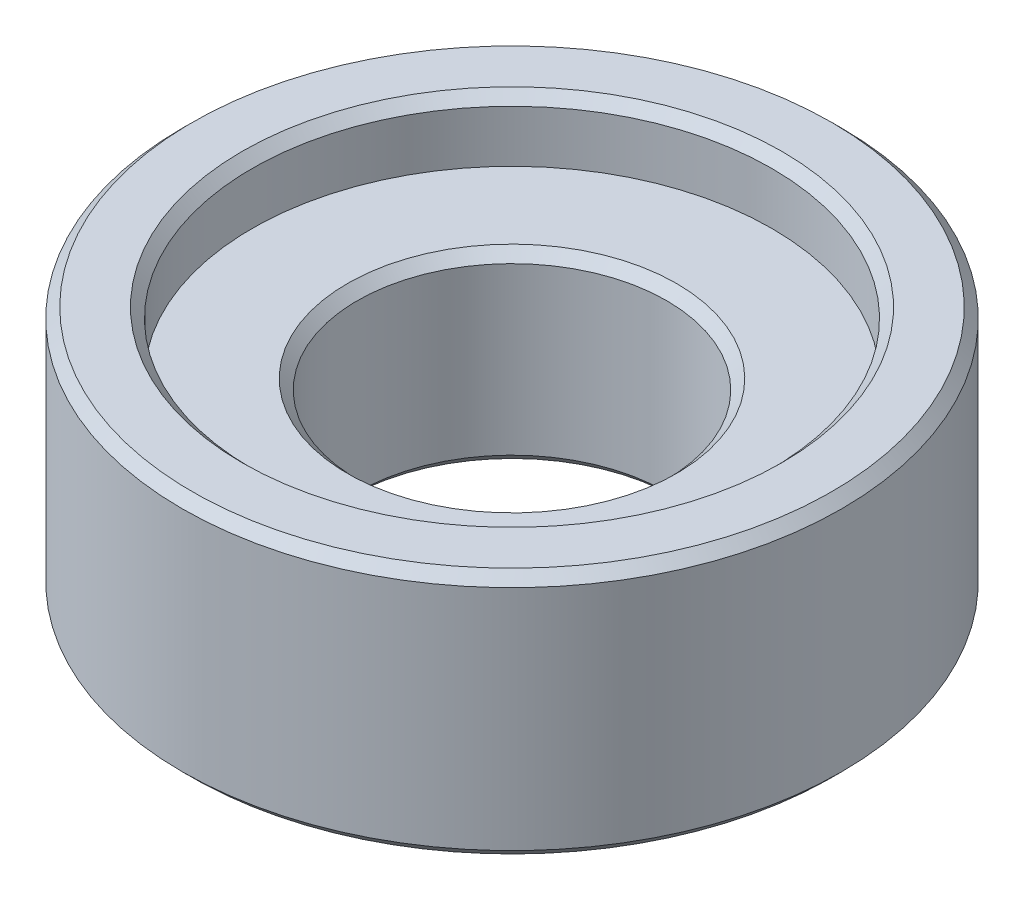
ISO-10303-21;
HEADER;
FILE_DESCRIPTION(('STEP AP214'),'2;1');
FILE_NAME('part.step','',(''),(''),'','','');
FILE_SCHEMA(('AUTOMOTIVE_DESIGN { 1 0 10303 214 1 1 1 1 }'));
ENDSEC;
DATA;
#1=APPLICATION_CONTEXT('core data for automotive mechanical design processes');
#2=APPLICATION_PROTOCOL_DEFINITION('international standard','automotive_design',2000,#1);
#3=PRODUCT_CONTEXT('',#1,'mechanical');
#4=PRODUCT('Part','Part','',(#3));
#5=PRODUCT_RELATED_PRODUCT_CATEGORY('part','',(#4));
#6=PRODUCT_DEFINITION_FORMATION('','',#4);
#7=PRODUCT_DEFINITION_CONTEXT('part definition',#1,'design');
#8=PRODUCT_DEFINITION('design','',#6,#7);
#9=PRODUCT_DEFINITION_SHAPE('','',#8);
#10=(LENGTH_UNIT() NAMED_UNIT(*) SI_UNIT(.MILLI.,.METRE.));
#11=(NAMED_UNIT(*) PLANE_ANGLE_UNIT() SI_UNIT($,.RADIAN.));
#12=(NAMED_UNIT(*) SI_UNIT($,.STERADIAN.) SOLID_ANGLE_UNIT());
#13=UNCERTAINTY_MEASURE_WITH_UNIT(LENGTH_MEASURE(1.E-05),#10,'distance_accuracy_value','');
#14=(GEOMETRIC_REPRESENTATION_CONTEXT(3) GLOBAL_UNCERTAINTY_ASSIGNED_CONTEXT((#13)) GLOBAL_UNIT_ASSIGNED_CONTEXT((#10,
#11,#12)) REPRESENTATION_CONTEXT('',''));
#15=CARTESIAN_POINT('',(0.,0.,0.));
#16=DIRECTION('',(0.,0.,1.));
#17=DIRECTION('',(1.,0.,0.));
#18=AXIS2_PLACEMENT_3D('',#15,#16,#17);
#19=CARTESIAN_POINT('',(0.,12.1920000000005,0.));
#20=DIRECTION('',(0.,-1.,0.));
#21=DIRECTION('',(0.,0.,-1.));
#22=AXIS2_PLACEMENT_3D('',#19,#20,#21);
#23=CONICAL_SURFACE('',#22,16.9163999999574,0.78539816339745);
#24=CARTESIAN_POINT('',(0.,12.7000000000005,0.));
#25=DIRECTION('',(0.,-1.,0.));
#26=DIRECTION('',(0.,0.,-1.));
#27=AXIS2_PLACEMENT_3D('',#24,#25,#26);
#28=CIRCLE('',#27,16.4083999999574);
#29=CARTESIAN_POINT('',(0.,12.7000000000005,-16.4083999999574));
#30=VERTEX_POINT('',#29);
#31=EDGE_CURVE('E10',#30,#30,#28,.T.);
#32=ORIENTED_EDGE('',*,*,#31,.T.);
#33=EDGE_LOOP('',(#32));
#34=FACE_BOUND('',#33,.T.);
#35=CARTESIAN_POINT('',(0.,12.1920000000005,0.));
#36=DIRECTION('',(0.,-1.,0.));
#37=DIRECTION('',(0.,0.,-1.));
#38=AXIS2_PLACEMENT_3D('',#35,#36,#37);
#39=CIRCLE('',#38,16.9163999999574);
#40=CARTESIAN_POINT('',(0.,12.1920000000005,-16.9163999999574));
#41=VERTEX_POINT('',#40);
#42=EDGE_CURVE('E67',#41,#41,#39,.T.);
#43=ORIENTED_EDGE('',*,*,#42,.F.);
#44=EDGE_LOOP('',(#43));
#45=FACE_BOUND('',#44,.T.);
#46=ADVANCED_FACE('F30',(#34,#45),#23,.T.);
#47=CARTESIAN_POINT('',(16.4083999999574,12.7000000000005,0.));
#48=DIRECTION('',(0.,1.,0.));
#49=DIRECTION('',(0.,0.,1.));
#50=AXIS2_PLACEMENT_3D('',#47,#48,#49);
#51=PLANE('',#50);
#52=CARTESIAN_POINT('',(0.,12.7000000000005,0.));
#53=DIRECTION('',(0.,-1.,0.));
#54=DIRECTION('',(0.,0.,-1.));
#55=AXIS2_PLACEMENT_3D('',#52,#53,#54);
#56=CIRCLE('',#55,13.8429999999573);
#57=CARTESIAN_POINT('',(0.,12.7000000000005,-13.8429999999573));
#58=VERTEX_POINT('',#57);
#59=EDGE_CURVE('E36',#58,#58,#56,.T.);
#60=ORIENTED_EDGE('',*,*,#59,.T.);
#61=EDGE_LOOP('',(#60));
#62=FACE_BOUND('',#61,.T.);
#63=ORIENTED_EDGE('',*,*,#31,.F.);
#64=EDGE_LOOP('',(#63));
#65=FACE_BOUND('',#64,.T.);
#66=ADVANCED_FACE('F75',(#62,#65),#51,.T.);
#67=CARTESIAN_POINT('',(0.,12.7000000000005,0.));
#68=DIRECTION('',(0.,1.,0.));
#69=DIRECTION('',(0.,0.,1.));
#70=AXIS2_PLACEMENT_3D('',#67,#68,#69);
#71=CONICAL_SURFACE('',#70,13.8429999999573,0.785398163397448);
#72=CARTESIAN_POINT('',(0.,12.1920000000005,0.));
#73=DIRECTION('',(0.,-1.,0.));
#74=DIRECTION('',(0.,0.,-1.));
#75=AXIS2_PLACEMENT_3D('',#72,#73,#74);
#76=CIRCLE('',#75,13.3349999999573);
#77=CARTESIAN_POINT('',(0.,12.1920000000005,-13.3349999999573));
#78=VERTEX_POINT('',#77);
#79=EDGE_CURVE('E40',#78,#78,#76,.T.);
#80=ORIENTED_EDGE('',*,*,#79,.T.);
#81=EDGE_LOOP('',(#80));
#82=FACE_BOUND('',#81,.T.);
#83=ORIENTED_EDGE('',*,*,#59,.F.);
#84=EDGE_LOOP('',(#83));
#85=FACE_BOUND('',#84,.T.);
#86=ADVANCED_FACE('F79',(#82,#85),#71,.F.);
#87=CARTESIAN_POINT('',(0.,12.7,0.));
#88=DIRECTION('',(0.,-1.,0.));
#89=DIRECTION('',(0.,0.,-1.));
#90=AXIS2_PLACEMENT_3D('',#87,#88,#89);
#91=CYLINDRICAL_SURFACE('',#90,13.3349999999573);
#92=CARTESIAN_POINT('',(0.,9.525,0.));
#93=DIRECTION('',(0.,-1.,0.));
#94=DIRECTION('',(0.,0.,-1.));
#95=AXIS2_PLACEMENT_3D('',#92,#93,#94);
#96=CIRCLE('',#95,13.3349999999573);
#97=CARTESIAN_POINT('',(0.,9.525,-13.3349999999573));
#98=VERTEX_POINT('',#97);
#99=EDGE_CURVE('E44',#98,#98,#96,.T.);
#100=ORIENTED_EDGE('',*,*,#99,.T.);
#101=EDGE_LOOP('',(#100));
#102=FACE_BOUND('',#101,.T.);
#103=ORIENTED_EDGE('',*,*,#79,.F.);
#104=EDGE_LOOP('',(#103));
#105=FACE_BOUND('',#104,.T.);
#106=ADVANCED_FACE('F83',(#102,#105),#91,.F.);
#107=CARTESIAN_POINT('',(13.3349999999573,9.525,0.));
#108=DIRECTION('',(0.,1.,0.));
#109=DIRECTION('',(0.,0.,1.));
#110=AXIS2_PLACEMENT_3D('',#107,#108,#109);
#111=PLANE('',#110);
#112=CARTESIAN_POINT('',(0.,9.525,0.));
#113=DIRECTION('',(0.,-1.,0.));
#114=DIRECTION('',(0.,0.,-1.));
#115=AXIS2_PLACEMENT_3D('',#112,#113,#114);
#116=CIRCLE('',#115,8.44550000000042);
#117=CARTESIAN_POINT('',(0.,9.525,-8.44550000000042));
#118=VERTEX_POINT('',#117);
#119=EDGE_CURVE('E49',#118,#118,#116,.T.);
#120=ORIENTED_EDGE('',*,*,#119,.T.);
#121=EDGE_LOOP('',(#120));
#122=FACE_BOUND('',#121,.T.);
#123=ORIENTED_EDGE('',*,*,#99,.F.);
#124=EDGE_LOOP('',(#123));
#125=FACE_BOUND('',#124,.T.);
#126=ADVANCED_FACE('F90',(#122,#125),#111,.T.);
#127=CARTESIAN_POINT('',(0.,9.525,0.));
#128=DIRECTION('',(0.,1.,0.));
#129=DIRECTION('',(0.,0.,1.));
#130=AXIS2_PLACEMENT_3D('',#127,#128,#129);
#131=CONICAL_SURFACE('',#130,8.44550000000042,0.785398163397448);
#132=CARTESIAN_POINT('',(0.,9.017,0.));
#133=DIRECTION('',(0.,-1.,0.));
#134=DIRECTION('',(0.,0.,-1.));
#135=AXIS2_PLACEMENT_3D('',#132,#133,#134);
#136=CIRCLE('',#135,7.93750000000042);
#137=CARTESIAN_POINT('',(0.,9.017,-7.93750000000042));
#138=VERTEX_POINT('',#137);
#139=EDGE_CURVE('E52',#138,#138,#136,.T.);
#140=ORIENTED_EDGE('',*,*,#139,.T.);
#141=EDGE_LOOP('',(#140));
#142=FACE_BOUND('',#141,.T.);
#143=ORIENTED_EDGE('',*,*,#119,.F.);
#144=EDGE_LOOP('',(#143));
#145=FACE_BOUND('',#144,.T.);
#146=ADVANCED_FACE('F94',(#142,#145),#131,.F.);
#147=CARTESIAN_POINT('',(0.,12.7,0.));
#148=DIRECTION('',(0.,-1.,0.));
#149=DIRECTION('',(0.,0.,-1.));
#150=AXIS2_PLACEMENT_3D('',#147,#148,#149);
#151=CYLINDRICAL_SURFACE('',#150,7.93750000000042);
#152=CARTESIAN_POINT('',(0.,0.508000000000418,0.));
#153=DIRECTION('',(0.,-1.,0.));
#154=DIRECTION('',(0.,0.,-1.));
#155=AXIS2_PLACEMENT_3D('',#152,#153,#154);
#156=CIRCLE('',#155,7.93750000000042);
#157=CARTESIAN_POINT('',(0.,0.508000000000418,-7.93750000000042));
#158=VERTEX_POINT('',#157);
#159=EDGE_CURVE('E55',#158,#158,#156,.T.);
#160=ORIENTED_EDGE('',*,*,#159,.T.);
#161=EDGE_LOOP('',(#160));
#162=FACE_BOUND('',#161,.T.);
#163=ORIENTED_EDGE('',*,*,#139,.F.);
#164=EDGE_LOOP('',(#163));
#165=FACE_BOUND('',#164,.T.);
#166=ADVANCED_FACE('F98',(#162,#165),#151,.F.);
#167=CARTESIAN_POINT('',(0.,0.508000000000418,0.));
#168=DIRECTION('',(0.,-1.,0.));
#169=DIRECTION('',(0.,0.,-1.));
#170=AXIS2_PLACEMENT_3D('',#167,#168,#169);
#171=CONICAL_SURFACE('',#170,7.93750000000042,0.7853981633973);
#172=CARTESIAN_POINT('',(0.,3.43475248243408E-13,0.));
#173=DIRECTION('',(0.,-1.,0.));
#174=DIRECTION('',(0.,0.,-1.));
#175=AXIS2_PLACEMENT_3D('',#172,#173,#174);
#176=CIRCLE('',#175,8.44550000000034);
#177=CARTESIAN_POINT('',(0.,3.43475248243408E-13,-8.44550000000034));
#178=VERTEX_POINT('',#177);
#179=EDGE_CURVE('E58',#178,#178,#176,.T.);
#180=ORIENTED_EDGE('',*,*,#179,.T.);
#181=EDGE_LOOP('',(#180));
#182=FACE_BOUND('',#181,.T.);
#183=ORIENTED_EDGE('',*,*,#159,.F.);
#184=EDGE_LOOP('',(#183));
#185=FACE_BOUND('',#184,.T.);
#186=ADVANCED_FACE('F102',(#182,#185),#171,.F.);
#187=CARTESIAN_POINT('',(8.44550000000034,3.81213432461527E-13,0.));
#188=DIRECTION('',(0.,-1.,0.));
#189=DIRECTION('',(0.,0.,-1.));
#190=AXIS2_PLACEMENT_3D('',#187,#188,#189);
#191=PLANE('',#190);
#192=CARTESIAN_POINT('',(0.,4.19803081186387E-13,0.));
#193=DIRECTION('',(0.,-1.,0.));
#194=DIRECTION('',(0.,0.,-1.));
#195=AXIS2_PLACEMENT_3D('',#192,#193,#194);
#196=CIRCLE('',#195,16.4084000000003);
#197=CARTESIAN_POINT('',(0.,4.19803081186387E-13,-16.4084000000003));
#198=VERTEX_POINT('',#197);
#199=EDGE_CURVE('E61',#198,#198,#196,.T.);
#200=ORIENTED_EDGE('',*,*,#199,.T.);
#201=EDGE_LOOP('',(#200));
#202=FACE_BOUND('',#201,.T.);
#203=ORIENTED_EDGE('',*,*,#179,.F.);
#204=EDGE_LOOP('',(#203));
#205=FACE_BOUND('',#204,.T.);
#206=ADVANCED_FACE('F106',(#202,#205),#191,.T.);
#207=CARTESIAN_POINT('',(0.,4.19803081186387E-13,0.));
#208=DIRECTION('',(0.,1.,0.));
#209=DIRECTION('',(0.,0.,1.));
#210=AXIS2_PLACEMENT_3D('',#207,#208,#209);
#211=CONICAL_SURFACE('',#210,16.4084000000003,0.785398163397448);
#212=CARTESIAN_POINT('',(0.,0.507999999957449,0.));
#213=DIRECTION('',(0.,-1.,0.));
#214=DIRECTION('',(0.,0.,-1.));
#215=AXIS2_PLACEMENT_3D('',#212,#213,#214);
#216=CIRCLE('',#215,16.9163999999574);
#217=CARTESIAN_POINT('',(0.,0.507999999957449,-16.9163999999574));
#218=VERTEX_POINT('',#217);
#219=EDGE_CURVE('E64',#218,#218,#216,.T.);
#220=ORIENTED_EDGE('',*,*,#219,.T.);
#221=EDGE_LOOP('',(#220));
#222=FACE_BOUND('',#221,.T.);
#223=ORIENTED_EDGE('',*,*,#199,.F.);
#224=EDGE_LOOP('',(#223));
#225=FACE_BOUND('',#224,.T.);
#226=ADVANCED_FACE('F110',(#222,#225),#211,.T.);
#227=CARTESIAN_POINT('',(0.,12.7,0.));
#228=DIRECTION('',(0.,-1.,0.));
#229=DIRECTION('',(0.,0.,-1.));
#230=AXIS2_PLACEMENT_3D('',#227,#228,#229);
#231=CYLINDRICAL_SURFACE('',#230,16.9163999999574);
#232=ORIENTED_EDGE('',*,*,#42,.T.);
#233=EDGE_LOOP('',(#232));
#234=FACE_BOUND('',#233,.T.);
#235=ORIENTED_EDGE('',*,*,#219,.F.);
#236=EDGE_LOOP('',(#235));
#237=FACE_BOUND('',#236,.T.);
#238=ADVANCED_FACE('F71',(#234,#237),#231,.T.);
#239=CLOSED_SHELL('',(#46,#66,#86,#106,#126,#146,#166,#186,#206,#226,#238));
#240=MANIFOLD_SOLID_BREP('B2',#239);
#241=ADVANCED_BREP_SHAPE_REPRESENTATION('',(#18,#240),#14);
#242=SHAPE_DEFINITION_REPRESENTATION(#9,#241);
ENDSEC;
END-ISO-10303-21;
